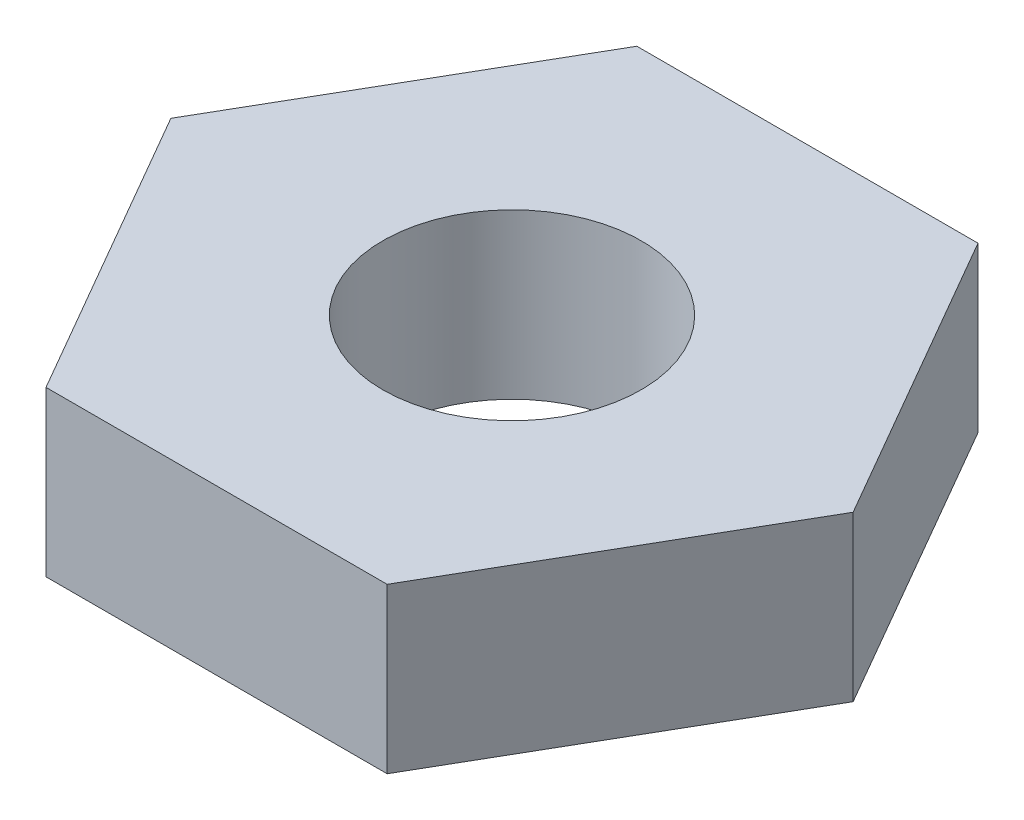
ISO-10303-21;
HEADER;
FILE_DESCRIPTION(('STEP AP214'),'2;1');
FILE_NAME('part.step','',(''),(''),'','','');
FILE_SCHEMA(('AUTOMOTIVE_DESIGN { 1 0 10303 214 1 1 1 1 }'));
ENDSEC;
DATA;
#1=APPLICATION_CONTEXT('core data for automotive mechanical design processes');
#2=APPLICATION_PROTOCOL_DEFINITION('international standard','automotive_design',2000,#1);
#3=PRODUCT_CONTEXT('',#1,'mechanical');
#4=PRODUCT('Part','Part','',(#3));
#5=PRODUCT_RELATED_PRODUCT_CATEGORY('part','',(#4));
#6=PRODUCT_DEFINITION_FORMATION('','',#4);
#7=PRODUCT_DEFINITION_CONTEXT('part definition',#1,'design');
#8=PRODUCT_DEFINITION('design','',#6,#7);
#9=PRODUCT_DEFINITION_SHAPE('','',#8);
#10=(LENGTH_UNIT() NAMED_UNIT(*) SI_UNIT(.MILLI.,.METRE.));
#11=(NAMED_UNIT(*) PLANE_ANGLE_UNIT() SI_UNIT($,.RADIAN.));
#12=(NAMED_UNIT(*) SI_UNIT($,.STERADIAN.) SOLID_ANGLE_UNIT());
#13=UNCERTAINTY_MEASURE_WITH_UNIT(LENGTH_MEASURE(1.E-05),#10,'distance_accuracy_value','');
#14=(GEOMETRIC_REPRESENTATION_CONTEXT(3) GLOBAL_UNCERTAINTY_ASSIGNED_CONTEXT((#13)) GLOBAL_UNIT_ASSIGNED_CONTEXT((#10,
#11,#12)) REPRESENTATION_CONTEXT('',''));
#15=CARTESIAN_POINT('',(0.,0.,0.));
#16=DIRECTION('',(0.,0.,1.));
#17=DIRECTION('',(1.,0.,0.));
#18=AXIS2_PLACEMENT_3D('',#15,#16,#17);
#19=CARTESIAN_POINT('',(0.,1.905,3.42999999999999));
#20=DIRECTION('',(0.,0.,-1.));
#21=DIRECTION('',(-1.,0.,0.));
#22=AXIS2_PLACEMENT_3D('',#19,#20,#21);
#23=PLANE('',#22);
#24=DIRECTION('',(1.,0.,0.));
#25=VECTOR('',#24,1.);
#26=CARTESIAN_POINT('',(0.,0.,3.42999999999999));
#27=LINE('',#26,#25);
#28=CARTESIAN_POINT('',(-1.98031142332038,0.,3.43000000000001));
#29=VERTEX_POINT('',#28);
#30=CARTESIAN_POINT('',(1.98031142332045,0.,3.42999999999997));
#31=VERTEX_POINT('',#30);
#32=EDGE_CURVE('E122',#29,#31,#27,.T.);
#33=ORIENTED_EDGE('',*,*,#32,.T.);
#34=DIRECTION('',(0.,-1.,0.));
#35=VECTOR('',#34,1.);
#36=CARTESIAN_POINT('',(1.98031142332045,1.905,3.42999999999997));
#37=LINE('',#36,#35);
#38=CARTESIAN_POINT('',(1.98031142332045,1.905,3.42999999999997));
#39=VERTEX_POINT('',#38);
#40=EDGE_CURVE('E11',#39,#31,#37,.T.);
#41=ORIENTED_EDGE('',*,*,#40,.F.);
#42=DIRECTION('',(1.,0.,0.));
#43=VECTOR('',#42,1.);
#44=CARTESIAN_POINT('',(0.,1.905,3.42999999999999));
#45=LINE('',#44,#43);
#46=CARTESIAN_POINT('',(-1.98031142332038,1.905,3.43000000000001));
#47=VERTEX_POINT('',#46);
#48=EDGE_CURVE('E145',#47,#39,#45,.T.);
#49=ORIENTED_EDGE('',*,*,#48,.F.);
#50=DIRECTION('',(0.,-1.,0.));
#51=VECTOR('',#50,1.);
#52=CARTESIAN_POINT('',(-1.98031142332038,1.905,3.43000000000001));
#53=LINE('',#52,#51);
#54=EDGE_CURVE('E115',#47,#29,#53,.T.);
#55=ORIENTED_EDGE('',*,*,#54,.T.);
#56=EDGE_LOOP('',(#33,#41,#49,#55));
#57=FACE_BOUND('',#56,.T.);
#58=ADVANCED_FACE('F34',(#57),#23,.F.);
#59=CARTESIAN_POINT('',(2.97046713498063,1.905,1.71499999999998));
#60=DIRECTION('',(-0.866025403784441,0.,-0.499999999999995));
#61=DIRECTION('',(-0.499999999999995,0.,0.866025403784442));
#62=AXIS2_PLACEMENT_3D('',#59,#60,#61);
#63=PLANE('',#62);
#64=DIRECTION('',(0.499999999999995,0.,-0.866025403784442));
#65=VECTOR('',#64,1.);
#66=CARTESIAN_POINT('',(2.97046713498063,0.,1.71499999999998));
#67=LINE('',#66,#65);
#68=CARTESIAN_POINT('',(3.96062284664082,0.,0.));
#69=VERTEX_POINT('',#68);
#70=EDGE_CURVE('E125',#31,#69,#67,.T.);
#71=ORIENTED_EDGE('',*,*,#70,.T.);
#72=DIRECTION('',(0.,-1.,0.));
#73=VECTOR('',#72,1.);
#74=CARTESIAN_POINT('',(3.96062284664082,1.905,0.));
#75=LINE('',#74,#73);
#76=CARTESIAN_POINT('',(3.96062284664082,1.905,0.));
#77=VERTEX_POINT('',#76);
#78=EDGE_CURVE('E43',#77,#69,#75,.T.);
#79=ORIENTED_EDGE('',*,*,#78,.F.);
#80=DIRECTION('',(0.499999999999995,0.,-0.866025403784442));
#81=VECTOR('',#80,1.);
#82=CARTESIAN_POINT('',(2.97046713498063,1.905,1.71499999999998));
#83=LINE('',#82,#81);
#84=EDGE_CURVE('E88',#39,#77,#83,.T.);
#85=ORIENTED_EDGE('',*,*,#84,.F.);
#86=ORIENTED_EDGE('',*,*,#40,.T.);
#87=EDGE_LOOP('',(#71,#79,#85,#86));
#88=FACE_BOUND('',#87,.T.);
#89=ADVANCED_FACE('F159',(#88),#63,.F.);
#90=CARTESIAN_POINT('',(2.97046713498061,1.905,-1.715));
#91=DIRECTION('',(-0.866025403784438,0.,0.500000000000001));
#92=DIRECTION('',(0.500000000000001,0.,0.866025403784438));
#93=AXIS2_PLACEMENT_3D('',#90,#91,#92);
#94=PLANE('',#93);
#95=DIRECTION('',(-0.500000000000001,0.,-0.866025403784438));
#96=VECTOR('',#95,1.);
#97=CARTESIAN_POINT('',(2.97046713498061,0.,-1.715));
#98=LINE('',#97,#96);
#99=CARTESIAN_POINT('',(1.9803114233204,0.,-3.42999999999999));
#100=VERTEX_POINT('',#99);
#101=EDGE_CURVE('E127',#69,#100,#98,.T.);
#102=ORIENTED_EDGE('',*,*,#101,.T.);
#103=DIRECTION('',(0.,-1.,0.));
#104=VECTOR('',#103,1.);
#105=CARTESIAN_POINT('',(1.9803114233204,1.905,-3.42999999999999));
#106=LINE('',#105,#104);
#107=CARTESIAN_POINT('',(1.9803114233204,1.905,-3.42999999999999));
#108=VERTEX_POINT('',#107);
#109=EDGE_CURVE('E110',#108,#100,#106,.T.);
#110=ORIENTED_EDGE('',*,*,#109,.F.);
#111=DIRECTION('',(-0.500000000000001,0.,-0.866025403784438));
#112=VECTOR('',#111,1.);
#113=CARTESIAN_POINT('',(2.97046713498061,1.905,-1.715));
#114=LINE('',#113,#112);
#115=EDGE_CURVE('E101',#77,#108,#114,.T.);
#116=ORIENTED_EDGE('',*,*,#115,.F.);
#117=ORIENTED_EDGE('',*,*,#78,.T.);
#118=EDGE_LOOP('',(#102,#110,#116,#117));
#119=FACE_BOUND('',#118,.T.);
#120=ADVANCED_FACE('F138',(#119),#94,.F.);
#121=CARTESIAN_POINT('',(0.,1.905,-3.42999999999999));
#122=DIRECTION('',(0.,0.,1.));
#123=DIRECTION('',(1.,0.,0.));
#124=AXIS2_PLACEMENT_3D('',#121,#122,#123);
#125=PLANE('',#124);
#126=DIRECTION('',(-1.,0.,0.));
#127=VECTOR('',#126,1.);
#128=CARTESIAN_POINT('',(0.,0.,-3.42999999999999));
#129=LINE('',#128,#127);
#130=CARTESIAN_POINT('',(-1.98031142332043,0.,-3.42999999999998));
#131=VERTEX_POINT('',#130);
#132=EDGE_CURVE('E109',#100,#131,#129,.T.);
#133=ORIENTED_EDGE('',*,*,#132,.T.);
#134=DIRECTION('',(0.,-1.,0.));
#135=VECTOR('',#134,1.);
#136=CARTESIAN_POINT('',(-1.98031142332043,1.905,-3.42999999999998));
#137=LINE('',#136,#135);
#138=CARTESIAN_POINT('',(-1.98031142332043,1.905,-3.42999999999998));
#139=VERTEX_POINT('',#138);
#140=EDGE_CURVE('E106',#139,#131,#137,.T.);
#141=ORIENTED_EDGE('',*,*,#140,.F.);
#142=DIRECTION('',(-1.,0.,0.));
#143=VECTOR('',#142,1.);
#144=CARTESIAN_POINT('',(0.,1.905,-3.42999999999999));
#145=LINE('',#144,#143);
#146=EDGE_CURVE('E95',#108,#139,#145,.T.);
#147=ORIENTED_EDGE('',*,*,#146,.F.);
#148=ORIENTED_EDGE('',*,*,#109,.T.);
#149=EDGE_LOOP('',(#133,#141,#147,#148));
#150=FACE_BOUND('',#149,.T.);
#151=ADVANCED_FACE('F107',(#150),#125,.F.);
#152=CARTESIAN_POINT('',(-2.97046713498062,1.905,-1.71499999999998));
#153=DIRECTION('',(0.866025403784441,0.,0.499999999999995));
#154=DIRECTION('',(0.499999999999995,0.,-0.866025403784442));
#155=AXIS2_PLACEMENT_3D('',#152,#153,#154);
#156=PLANE('',#155);
#157=DIRECTION('',(-0.499999999999995,0.,0.866025403784442));
#158=VECTOR('',#157,1.);
#159=CARTESIAN_POINT('',(-2.97046713498062,0.,-1.71499999999998));
#160=LINE('',#159,#158);
#161=CARTESIAN_POINT('',(-3.96062284664082,0.,0.));
#162=VERTEX_POINT('',#161);
#163=EDGE_CURVE('E74',#131,#162,#160,.T.);
#164=ORIENTED_EDGE('',*,*,#163,.T.);
#165=DIRECTION('',(0.,-1.,0.));
#166=VECTOR('',#165,1.);
#167=CARTESIAN_POINT('',(-3.96062284664082,1.905,0.));
#168=LINE('',#167,#166);
#169=CARTESIAN_POINT('',(-3.96062284664082,1.905,0.));
#170=VERTEX_POINT('',#169);
#171=EDGE_CURVE('E111',#170,#162,#168,.T.);
#172=ORIENTED_EDGE('',*,*,#171,.F.);
#173=DIRECTION('',(-0.499999999999995,0.,0.866025403784442));
#174=VECTOR('',#173,1.);
#175=CARTESIAN_POINT('',(-2.97046713498062,1.905,-1.71499999999998));
#176=LINE('',#175,#174);
#177=EDGE_CURVE('E99',#139,#170,#176,.T.);
#178=ORIENTED_EDGE('',*,*,#177,.F.);
#179=ORIENTED_EDGE('',*,*,#140,.T.);
#180=EDGE_LOOP('',(#164,#172,#178,#179));
#181=FACE_BOUND('',#180,.T.);
#182=ADVANCED_FACE('F113',(#181),#156,.F.);
#183=CARTESIAN_POINT('',(0.,1.905,0.));
#184=DIRECTION('',(0.,-1.,0.));
#185=DIRECTION('',(0.,0.,-1.));
#186=AXIS2_PLACEMENT_3D('',#183,#184,#185);
#187=CYLINDRICAL_SURFACE('',#186,1.5);
#188=CARTESIAN_POINT('',(0.,1.905,0.));
#189=DIRECTION('',(0.,1.,0.));
#190=DIRECTION('',(0.,0.,1.));
#191=AXIS2_PLACEMENT_3D('',#188,#189,#190);
#192=CIRCLE('',#191,1.5);
#193=CARTESIAN_POINT('',(0.,1.905,1.5));
#194=VERTEX_POINT('',#193);
#195=EDGE_CURVE('E132',#194,#194,#192,.T.);
#196=ORIENTED_EDGE('',*,*,#195,.T.);
#197=EDGE_LOOP('',(#196));
#198=FACE_BOUND('',#197,.T.);
#199=CARTESIAN_POINT('',(0.,0.,0.));
#200=DIRECTION('',(0.,1.,0.));
#201=DIRECTION('',(0.,0.,1.));
#202=AXIS2_PLACEMENT_3D('',#199,#200,#201);
#203=CIRCLE('',#202,1.5);
#204=CARTESIAN_POINT('',(0.,0.,1.5));
#205=VERTEX_POINT('',#204);
#206=EDGE_CURVE('E119',#205,#205,#203,.T.);
#207=ORIENTED_EDGE('',*,*,#206,.F.);
#208=EDGE_LOOP('',(#207));
#209=FACE_BOUND('',#208,.T.);
#210=ADVANCED_FACE('F36',(#198,#209),#187,.F.);
#211=CARTESIAN_POINT('',(-2.9704671349806,1.905,1.71500000000002));
#212=DIRECTION('',(0.866025403784434,0.,-0.500000000000007));
#213=DIRECTION('',(-0.500000000000007,0.,-0.866025403784435));
#214=AXIS2_PLACEMENT_3D('',#211,#212,#213);
#215=PLANE('',#214);
#216=DIRECTION('',(0.500000000000007,0.,0.866025403784435));
#217=VECTOR('',#216,1.);
#218=CARTESIAN_POINT('',(-2.9704671349806,0.,1.71500000000002));
#219=LINE('',#218,#217);
#220=EDGE_CURVE('E80',#162,#29,#219,.T.);
#221=ORIENTED_EDGE('',*,*,#220,.T.);
#222=ORIENTED_EDGE('',*,*,#54,.F.);
#223=DIRECTION('',(0.500000000000007,0.,0.866025403784435));
#224=VECTOR('',#223,1.);
#225=CARTESIAN_POINT('',(-2.9704671349806,1.905,1.71500000000002));
#226=LINE('',#225,#224);
#227=EDGE_CURVE('E51',#170,#47,#226,.T.);
#228=ORIENTED_EDGE('',*,*,#227,.F.);
#229=ORIENTED_EDGE('',*,*,#171,.T.);
#230=EDGE_LOOP('',(#221,#222,#228,#229));
#231=FACE_BOUND('',#230,.T.);
#232=ADVANCED_FACE('F146',(#231),#215,.F.);
#233=CARTESIAN_POINT('',(0.,1.905,0.));
#234=DIRECTION('',(0.,1.,0.));
#235=DIRECTION('',(0.,0.,1.));
#236=AXIS2_PLACEMENT_3D('',#233,#234,#235);
#237=PLANE('',#236);
#238=ORIENTED_EDGE('',*,*,#195,.F.);
#239=EDGE_LOOP('',(#238));
#240=FACE_BOUND('',#239,.T.);
#241=ORIENTED_EDGE('',*,*,#48,.T.);
#242=ORIENTED_EDGE('',*,*,#84,.T.);
#243=ORIENTED_EDGE('',*,*,#115,.T.);
#244=ORIENTED_EDGE('',*,*,#146,.T.);
#245=ORIENTED_EDGE('',*,*,#177,.T.);
#246=ORIENTED_EDGE('',*,*,#227,.T.);
#247=EDGE_LOOP('',(#241,#242,#243,#244,#245,#246));
#248=FACE_BOUND('',#247,.T.);
#249=ADVANCED_FACE('F97',(#240,#248),#237,.T.);
#250=CARTESIAN_POINT('',(0.,0.,0.));
#251=DIRECTION('',(0.,1.,0.));
#252=DIRECTION('',(0.,0.,1.));
#253=AXIS2_PLACEMENT_3D('',#250,#251,#252);
#254=PLANE('',#253);
#255=ORIENTED_EDGE('',*,*,#206,.T.);
#256=EDGE_LOOP('',(#255));
#257=FACE_BOUND('',#256,.T.);
#258=ORIENTED_EDGE('',*,*,#32,.F.);
#259=ORIENTED_EDGE('',*,*,#220,.F.);
#260=ORIENTED_EDGE('',*,*,#163,.F.);
#261=ORIENTED_EDGE('',*,*,#132,.F.);
#262=ORIENTED_EDGE('',*,*,#101,.F.);
#263=ORIENTED_EDGE('',*,*,#70,.F.);
#264=EDGE_LOOP('',(#258,#259,#260,#261,#262,#263));
#265=FACE_BOUND('',#264,.T.);
#266=ADVANCED_FACE('F141',(#257,#265),#254,.F.);
#267=CLOSED_SHELL('',(#58,#89,#120,#151,#182,#210,#232,#249,#266));
#268=MANIFOLD_SOLID_BREP('B2',#267);
#269=ADVANCED_BREP_SHAPE_REPRESENTATION('',(#18,#268),#14);
#270=SHAPE_DEFINITION_REPRESENTATION(#9,#269);
ENDSEC;
END-ISO-10303-21;
